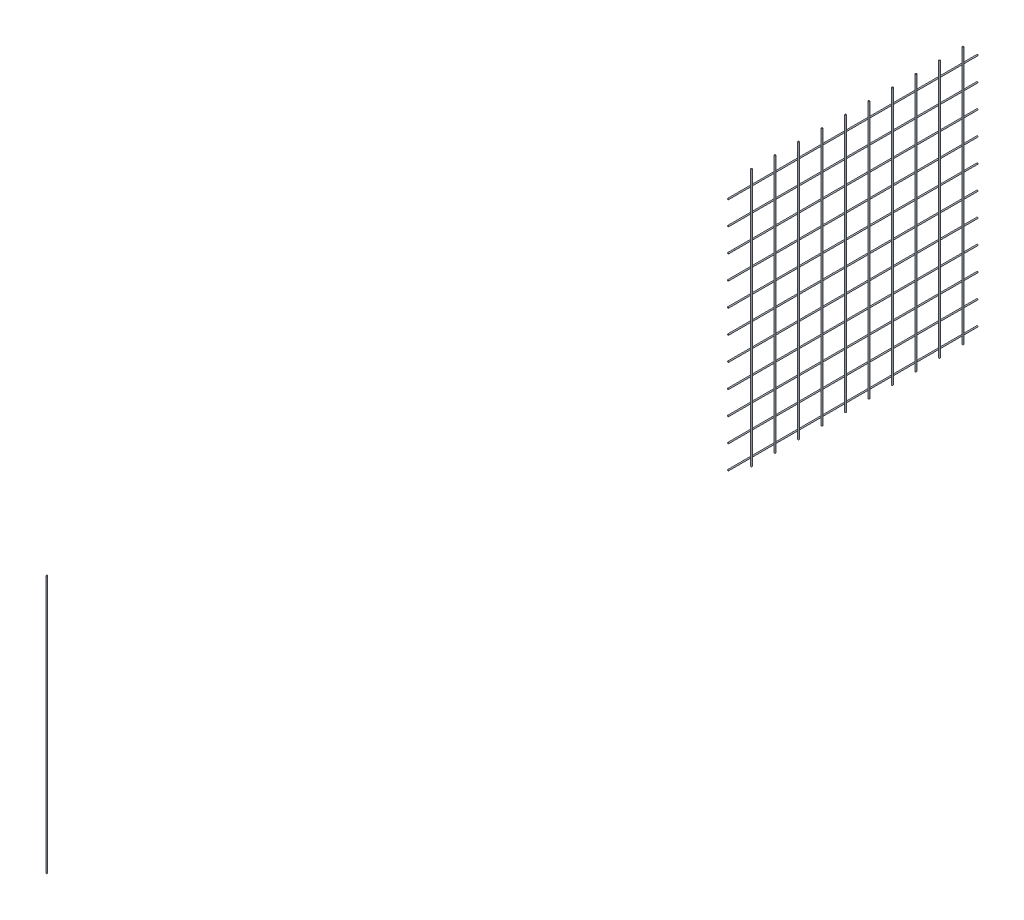
ISO-10303-21;
HEADER;
FILE_DESCRIPTION(('STEP AP214'),'2;1');
FILE_NAME('part.step','',(''),(''),'','','');
FILE_SCHEMA(('AUTOMOTIVE_DESIGN { 1 0 10303 214 1 1 1 1 }'));
ENDSEC;
DATA;
#1=APPLICATION_CONTEXT('core data for automotive mechanical design processes');
#2=APPLICATION_PROTOCOL_DEFINITION('international standard','automotive_design',2000,#1);
#3=PRODUCT_CONTEXT('',#1,'mechanical');
#4=PRODUCT('Part','Part','',(#3));
#5=PRODUCT_RELATED_PRODUCT_CATEGORY('part','',(#4));
#6=PRODUCT_DEFINITION_FORMATION('','',#4);
#7=PRODUCT_DEFINITION_CONTEXT('part definition',#1,'design');
#8=PRODUCT_DEFINITION('design','',#6,#7);
#9=PRODUCT_DEFINITION_SHAPE('','',#8);
#10=(LENGTH_UNIT() NAMED_UNIT(*) SI_UNIT(.MILLI.,.METRE.));
#11=(NAMED_UNIT(*) PLANE_ANGLE_UNIT() SI_UNIT($,.RADIAN.));
#12=(NAMED_UNIT(*) SI_UNIT($,.STERADIAN.) SOLID_ANGLE_UNIT());
#13=UNCERTAINTY_MEASURE_WITH_UNIT(LENGTH_MEASURE(1.E-05),#10,'distance_accuracy_value','');
#14=(GEOMETRIC_REPRESENTATION_CONTEXT(3) GLOBAL_UNCERTAINTY_ASSIGNED_CONTEXT((#13)) GLOBAL_UNIT_ASSIGNED_CONTEXT((#10,
#11,#12)) REPRESENTATION_CONTEXT('',''));
#15=CARTESIAN_POINT('',(0.,0.,0.));
#16=DIRECTION('',(0.,0.,1.));
#17=DIRECTION('',(1.,0.,0.));
#18=AXIS2_PLACEMENT_3D('',#15,#16,#17);
#19=CARTESIAN_POINT('',(-20.010000000005,1940.,-2403.));
#20=DIRECTION('',(0.,0.,1.));
#21=DIRECTION('',(1.,0.,0.));
#22=AXIS2_PLACEMENT_3D('',#19,#20,#21);
#23=PLANE('',#22);
#24=CARTESIAN_POINT('',(-5.32907051820075E-12,1300.,-2403.));
#25=DIRECTION('',(0.,0.,1.));
#26=DIRECTION('',(1.,0.,0.));
#27=AXIS2_PLACEMENT_3D('',#24,#25,#26);
#28=CIRCLE('',#27,1.49999999999986);
#29=CARTESIAN_POINT('',(1.49999999999454,1300.,-2403.));
#30=VERTEX_POINT('',#29);
#31=EDGE_CURVE('E58',#30,#30,#28,.T.);
#32=ORIENTED_EDGE('',*,*,#31,.T.);
#33=EDGE_LOOP('',(#32));
#34=FACE_BOUND('',#33,.T.);
#35=ADVANCED_FACE('F54',(#34),#23,.T.);
#36=CARTESIAN_POINT('',(0.,1300.,-3080.002));
#37=DIRECTION('',(0.,0.,1.));
#38=DIRECTION('',(1.,0.,0.));
#39=AXIS2_PLACEMENT_3D('',#36,#37,#38);
#40=CYLINDRICAL_SURFACE('',#39,1.49999999999986);
#41=CARTESIAN_POINT('',(-5.32907051820075E-12,1300.,-3040.));
#42=DIRECTION('',(0.,0.,-1.));
#43=DIRECTION('',(-1.,0.,0.));
#44=AXIS2_PLACEMENT_3D('',#41,#42,#43);
#45=CIRCLE('',#44,1.49999999999986);
#46=CARTESIAN_POINT('',(-1.50000000000519,1300.,-3040.));
#47=VERTEX_POINT('',#46);
#48=EDGE_CURVE('E11',#47,#47,#45,.T.);
#49=ORIENTED_EDGE('',*,*,#48,.F.);
#50=EDGE_LOOP('',(#49));
#51=FACE_BOUND('',#50,.T.);
#52=ORIENTED_EDGE('',*,*,#31,.F.);
#53=EDGE_LOOP('',(#52));
#54=FACE_BOUND('',#53,.T.);
#55=ADVANCED_FACE('F56',(#51,#54),#40,.T.);
#56=CARTESIAN_POINT('',(-15.4999999999997,-4.44089209850063E-13,-3040.));
#57=DIRECTION('',(0.,0.,-1.));
#58=DIRECTION('',(-1.,0.,0.));
#59=AXIS2_PLACEMENT_3D('',#56,#57,#58);
#60=PLANE('',#59);
#61=ORIENTED_EDGE('',*,*,#48,.T.);
#62=EDGE_LOOP('',(#61));
#63=FACE_BOUND('',#62,.T.);
#64=ADVANCED_FACE('F73',(#63),#60,.T.);
#65=CLOSED_SHELL('',(#35,#55,#64));
#66=MANIFOLD_SOLID_BREP('B2',#65);
#67=CARTESIAN_POINT('',(-20.010000000005,1940.,-2403.));
#68=DIRECTION('',(0.,0.,1.));
#69=DIRECTION('',(1.,0.,0.));
#70=AXIS2_PLACEMENT_3D('',#67,#68,#69);
#71=PLANE('',#70);
#72=CARTESIAN_POINT('',(0.,1360.,-2403.));
#73=DIRECTION('',(0.,0.,1.));
#74=DIRECTION('',(1.,0.,0.));
#75=AXIS2_PLACEMENT_3D('',#72,#73,#74);
#76=CIRCLE('',#75,1.49999999999986);
#77=CARTESIAN_POINT('',(1.49999999999988,1360.,-2403.));
#78=VERTEX_POINT('',#77);
#79=EDGE_CURVE('E105',#78,#78,#76,.T.);
#80=ORIENTED_EDGE('',*,*,#79,.T.);
#81=EDGE_LOOP('',(#80));
#82=FACE_BOUND('',#81,.T.);
#83=ADVANCED_FACE('F101',(#82),#71,.T.);
#84=CARTESIAN_POINT('',(0.,1360.,-3080.002));
#85=DIRECTION('',(0.,0.,1.));
#86=DIRECTION('',(1.,0.,0.));
#87=AXIS2_PLACEMENT_3D('',#84,#85,#86);
#88=CYLINDRICAL_SURFACE('',#87,1.49999999999986);
#89=CARTESIAN_POINT('',(0.,1360.,-3040.));
#90=DIRECTION('',(0.,0.,-1.));
#91=DIRECTION('',(-1.,0.,0.));
#92=AXIS2_PLACEMENT_3D('',#89,#90,#91);
#93=CIRCLE('',#92,1.49999999999986);
#94=CARTESIAN_POINT('',(-1.49999999999985,1360.,-3040.));
#95=VERTEX_POINT('',#94);
#96=EDGE_CURVE('E53',#95,#95,#93,.T.);
#97=ORIENTED_EDGE('',*,*,#96,.F.);
#98=EDGE_LOOP('',(#97));
#99=FACE_BOUND('',#98,.T.);
#100=ORIENTED_EDGE('',*,*,#79,.F.);
#101=EDGE_LOOP('',(#100));
#102=FACE_BOUND('',#101,.T.);
#103=ADVANCED_FACE('F103',(#99,#102),#88,.T.);
#104=CARTESIAN_POINT('',(-15.4999999999997,-4.44089209850063E-13,-3040.));
#105=DIRECTION('',(0.,0.,-1.));
#106=DIRECTION('',(-1.,0.,0.));
#107=AXIS2_PLACEMENT_3D('',#104,#105,#106);
#108=PLANE('',#107);
#109=ORIENTED_EDGE('',*,*,#96,.T.);
#110=EDGE_LOOP('',(#109));
#111=FACE_BOUND('',#110,.T.);
#112=ADVANCED_FACE('F120',(#111),#108,.T.);
#113=CLOSED_SHELL('',(#83,#103,#112));
#114=MANIFOLD_SOLID_BREP('B6',#113);
#115=CARTESIAN_POINT('',(-20.010000000005,1940.,-2403.));
#116=DIRECTION('',(0.,0.,1.));
#117=DIRECTION('',(1.,0.,0.));
#118=AXIS2_PLACEMENT_3D('',#115,#116,#117);
#119=PLANE('',#118);
#120=CARTESIAN_POINT('',(0.,1420.,-2403.));
#121=DIRECTION('',(0.,0.,1.));
#122=DIRECTION('',(1.,0.,0.));
#123=AXIS2_PLACEMENT_3D('',#120,#121,#122);
#124=CIRCLE('',#123,1.49999999999986);
#125=CARTESIAN_POINT('',(1.49999999999989,1420.,-2403.));
#126=VERTEX_POINT('',#125);
#127=EDGE_CURVE('E152',#126,#126,#124,.T.);
#128=ORIENTED_EDGE('',*,*,#127,.T.);
#129=EDGE_LOOP('',(#128));
#130=FACE_BOUND('',#129,.T.);
#131=ADVANCED_FACE('F148',(#130),#119,.T.);
#132=CARTESIAN_POINT('',(5.3550913703404E-12,1420.,-3080.002));
#133=DIRECTION('',(0.,0.,1.));
#134=DIRECTION('',(1.,0.,0.));
#135=AXIS2_PLACEMENT_3D('',#132,#133,#134);
#136=CYLINDRICAL_SURFACE('',#135,1.49999999999986);
#137=CARTESIAN_POINT('',(0.,1420.,-3040.));
#138=DIRECTION('',(0.,0.,-1.));
#139=DIRECTION('',(-1.,0.,0.));
#140=AXIS2_PLACEMENT_3D('',#137,#138,#139);
#141=CIRCLE('',#140,1.49999999999986);
#142=CARTESIAN_POINT('',(-1.49999999999984,1420.,-3040.));
#143=VERTEX_POINT('',#142);
#144=EDGE_CURVE('E100',#143,#143,#141,.T.);
#145=ORIENTED_EDGE('',*,*,#144,.F.);
#146=EDGE_LOOP('',(#145));
#147=FACE_BOUND('',#146,.T.);
#148=ORIENTED_EDGE('',*,*,#127,.F.);
#149=EDGE_LOOP('',(#148));
#150=FACE_BOUND('',#149,.T.);
#151=ADVANCED_FACE('F150',(#147,#150),#136,.T.);
#152=CARTESIAN_POINT('',(-15.4999999999997,-4.44089209850063E-13,-3040.));
#153=DIRECTION('',(0.,0.,-1.));
#154=DIRECTION('',(-1.,0.,0.));
#155=AXIS2_PLACEMENT_3D('',#152,#153,#154);
#156=PLANE('',#155);
#157=ORIENTED_EDGE('',*,*,#144,.T.);
#158=EDGE_LOOP('',(#157));
#159=FACE_BOUND('',#158,.T.);
#160=ADVANCED_FACE('F167',(#159),#156,.T.);
#161=CLOSED_SHELL('',(#131,#151,#160));
#162=MANIFOLD_SOLID_BREP('B48',#161);
#163=CARTESIAN_POINT('',(-20.010000000005,1940.,-2403.));
#164=DIRECTION('',(0.,0.,1.));
#165=DIRECTION('',(1.,0.,0.));
#166=AXIS2_PLACEMENT_3D('',#163,#164,#165);
#167=PLANE('',#166);
#168=CARTESIAN_POINT('',(0.,1480.,-2403.));
#169=DIRECTION('',(0.,0.,1.));
#170=DIRECTION('',(1.,0.,0.));
#171=AXIS2_PLACEMENT_3D('',#168,#169,#170);
#172=CIRCLE('',#171,1.49999999999986);
#173=CARTESIAN_POINT('',(1.49999999999989,1480.,-2403.));
#174=VERTEX_POINT('',#173);
#175=EDGE_CURVE('E199',#174,#174,#172,.T.);
#176=ORIENTED_EDGE('',*,*,#175,.T.);
#177=EDGE_LOOP('',(#176));
#178=FACE_BOUND('',#177,.T.);
#179=ADVANCED_FACE('F195',(#178),#167,.T.);
#180=CARTESIAN_POINT('',(0.,1480.,-3080.002));
#181=DIRECTION('',(0.,0.,1.));
#182=DIRECTION('',(1.,0.,0.));
#183=AXIS2_PLACEMENT_3D('',#180,#181,#182);
#184=CYLINDRICAL_SURFACE('',#183,1.49999999999986);
#185=CARTESIAN_POINT('',(0.,1480.,-3040.));
#186=DIRECTION('',(0.,0.,-1.));
#187=DIRECTION('',(-1.,0.,0.));
#188=AXIS2_PLACEMENT_3D('',#185,#186,#187);
#189=CIRCLE('',#188,1.49999999999986);
#190=CARTESIAN_POINT('',(-1.49999999999984,1480.,-3040.));
#191=VERTEX_POINT('',#190);
#192=EDGE_CURVE('E147',#191,#191,#189,.T.);
#193=ORIENTED_EDGE('',*,*,#192,.F.);
#194=EDGE_LOOP('',(#193));
#195=FACE_BOUND('',#194,.T.);
#196=ORIENTED_EDGE('',*,*,#175,.F.);
#197=EDGE_LOOP('',(#196));
#198=FACE_BOUND('',#197,.T.);
#199=ADVANCED_FACE('F197',(#195,#198),#184,.T.);
#200=CARTESIAN_POINT('',(-15.4999999999997,-4.44089209850063E-13,-3040.));
#201=DIRECTION('',(0.,0.,-1.));
#202=DIRECTION('',(-1.,0.,0.));
#203=AXIS2_PLACEMENT_3D('',#200,#201,#202);
#204=PLANE('',#203);
#205=ORIENTED_EDGE('',*,*,#192,.T.);
#206=EDGE_LOOP('',(#205));
#207=FACE_BOUND('',#206,.T.);
#208=ADVANCED_FACE('F214',(#207),#204,.T.);
#209=CLOSED_SHELL('',(#179,#199,#208));
#210=MANIFOLD_SOLID_BREP('B95',#209);
#211=CARTESIAN_POINT('',(-20.010000000005,1940.,-2403.));
#212=DIRECTION('',(0.,0.,1.));
#213=DIRECTION('',(1.,0.,0.));
#214=AXIS2_PLACEMENT_3D('',#211,#212,#213);
#215=PLANE('',#214);
#216=CARTESIAN_POINT('',(0.,1540.,-2403.));
#217=DIRECTION('',(0.,0.,1.));
#218=DIRECTION('',(1.,0.,0.));
#219=AXIS2_PLACEMENT_3D('',#216,#217,#218);
#220=CIRCLE('',#219,1.49999999999986);
#221=CARTESIAN_POINT('',(1.49999999999989,1540.,-2403.));
#222=VERTEX_POINT('',#221);
#223=EDGE_CURVE('E246',#222,#222,#220,.T.);
#224=ORIENTED_EDGE('',*,*,#223,.T.);
#225=EDGE_LOOP('',(#224));
#226=FACE_BOUND('',#225,.T.);
#227=ADVANCED_FACE('F242',(#226),#215,.T.);
#228=CARTESIAN_POINT('',(5.3550913703404E-12,1540.,-3080.002));
#229=DIRECTION('',(0.,0.,1.));
#230=DIRECTION('',(1.,0.,0.));
#231=AXIS2_PLACEMENT_3D('',#228,#229,#230);
#232=CYLINDRICAL_SURFACE('',#231,1.49999999999986);
#233=CARTESIAN_POINT('',(0.,1540.,-3040.));
#234=DIRECTION('',(0.,0.,-1.));
#235=DIRECTION('',(-1.,0.,0.));
#236=AXIS2_PLACEMENT_3D('',#233,#234,#235);
#237=CIRCLE('',#236,1.49999999999986);
#238=CARTESIAN_POINT('',(-1.49999999999984,1540.,-3040.));
#239=VERTEX_POINT('',#238);
#240=EDGE_CURVE('E194',#239,#239,#237,.T.);
#241=ORIENTED_EDGE('',*,*,#240,.F.);
#242=EDGE_LOOP('',(#241));
#243=FACE_BOUND('',#242,.T.);
#244=ORIENTED_EDGE('',*,*,#223,.F.);
#245=EDGE_LOOP('',(#244));
#246=FACE_BOUND('',#245,.T.);
#247=ADVANCED_FACE('F244',(#243,#246),#232,.T.);
#248=CARTESIAN_POINT('',(-15.4999999999997,-4.44089209850063E-13,-3040.));
#249=DIRECTION('',(0.,0.,-1.));
#250=DIRECTION('',(-1.,0.,0.));
#251=AXIS2_PLACEMENT_3D('',#248,#249,#250);
#252=PLANE('',#251);
#253=ORIENTED_EDGE('',*,*,#240,.T.);
#254=EDGE_LOOP('',(#253));
#255=FACE_BOUND('',#254,.T.);
#256=ADVANCED_FACE('F261',(#255),#252,.T.);
#257=CLOSED_SHELL('',(#227,#247,#256));
#258=MANIFOLD_SOLID_BREP('B142',#257);
#259=CARTESIAN_POINT('',(-20.010000000005,1940.,-2403.));
#260=DIRECTION('',(0.,0.,1.));
#261=DIRECTION('',(1.,0.,0.));
#262=AXIS2_PLACEMENT_3D('',#259,#260,#261);
#263=PLANE('',#262);
#264=CARTESIAN_POINT('',(0.,1600.,-2403.));
#265=DIRECTION('',(0.,0.,1.));
#266=DIRECTION('',(1.,0.,0.));
#267=AXIS2_PLACEMENT_3D('',#264,#265,#266);
#268=CIRCLE('',#267,1.49999999999986);
#269=CARTESIAN_POINT('',(1.49999999999989,1600.,-2403.));
#270=VERTEX_POINT('',#269);
#271=EDGE_CURVE('E293',#270,#270,#268,.T.);
#272=ORIENTED_EDGE('',*,*,#271,.T.);
#273=EDGE_LOOP('',(#272));
#274=FACE_BOUND('',#273,.T.);
#275=ADVANCED_FACE('F289',(#274),#263,.T.);
#276=CARTESIAN_POINT('',(0.,1600.,-3080.002));
#277=DIRECTION('',(0.,0.,1.));
#278=DIRECTION('',(1.,0.,0.));
#279=AXIS2_PLACEMENT_3D('',#276,#277,#278);
#280=CYLINDRICAL_SURFACE('',#279,1.49999999999986);
#281=CARTESIAN_POINT('',(0.,1600.,-3040.));
#282=DIRECTION('',(0.,0.,-1.));
#283=DIRECTION('',(-1.,0.,0.));
#284=AXIS2_PLACEMENT_3D('',#281,#282,#283);
#285=CIRCLE('',#284,1.49999999999986);
#286=CARTESIAN_POINT('',(-1.49999999999984,1600.,-3040.));
#287=VERTEX_POINT('',#286);
#288=EDGE_CURVE('E241',#287,#287,#285,.T.);
#289=ORIENTED_EDGE('',*,*,#288,.F.);
#290=EDGE_LOOP('',(#289));
#291=FACE_BOUND('',#290,.T.);
#292=ORIENTED_EDGE('',*,*,#271,.F.);
#293=EDGE_LOOP('',(#292));
#294=FACE_BOUND('',#293,.T.);
#295=ADVANCED_FACE('F291',(#291,#294),#280,.T.);
#296=CARTESIAN_POINT('',(-15.4999999999997,-4.44089209850063E-13,-3040.));
#297=DIRECTION('',(0.,0.,-1.));
#298=DIRECTION('',(-1.,0.,0.));
#299=AXIS2_PLACEMENT_3D('',#296,#297,#298);
#300=PLANE('',#299);
#301=ORIENTED_EDGE('',*,*,#288,.T.);
#302=EDGE_LOOP('',(#301));
#303=FACE_BOUND('',#302,.T.);
#304=ADVANCED_FACE('F308',(#303),#300,.T.);
#305=CLOSED_SHELL('',(#275,#295,#304));
#306=MANIFOLD_SOLID_BREP('B189',#305);
#307=CARTESIAN_POINT('',(-20.010000000005,1940.,-2403.));
#308=DIRECTION('',(0.,0.,1.));
#309=DIRECTION('',(1.,0.,0.));
#310=AXIS2_PLACEMENT_3D('',#307,#308,#309);
#311=PLANE('',#310);
#312=CARTESIAN_POINT('',(0.,1660.,-2403.));
#313=DIRECTION('',(0.,0.,1.));
#314=DIRECTION('',(1.,0.,0.));
#315=AXIS2_PLACEMENT_3D('',#312,#313,#314);
#316=CIRCLE('',#315,1.49999999999986);
#317=CARTESIAN_POINT('',(1.49999999999986,1660.,-2403.));
#318=VERTEX_POINT('',#317);
#319=EDGE_CURVE('E340',#318,#318,#316,.T.);
#320=ORIENTED_EDGE('',*,*,#319,.T.);
#321=EDGE_LOOP('',(#320));
#322=FACE_BOUND('',#321,.T.);
#323=ADVANCED_FACE('F336',(#322),#311,.T.);
#324=CARTESIAN_POINT('',(5.32907051820075E-12,1660.,-3080.002));
#325=DIRECTION('',(0.,0.,1.));
#326=DIRECTION('',(1.,0.,0.));
#327=AXIS2_PLACEMENT_3D('',#324,#325,#326);
#328=CYLINDRICAL_SURFACE('',#327,1.49999999999986);
#329=CARTESIAN_POINT('',(0.,1660.,-3040.));
#330=DIRECTION('',(0.,0.,-1.));
#331=DIRECTION('',(-1.,0.,0.));
#332=AXIS2_PLACEMENT_3D('',#329,#330,#331);
#333=CIRCLE('',#332,1.49999999999986);
#334=CARTESIAN_POINT('',(-1.49999999999986,1660.,-3040.));
#335=VERTEX_POINT('',#334);
#336=EDGE_CURVE('E288',#335,#335,#333,.T.);
#337=ORIENTED_EDGE('',*,*,#336,.F.);
#338=EDGE_LOOP('',(#337));
#339=FACE_BOUND('',#338,.T.);
#340=ORIENTED_EDGE('',*,*,#319,.F.);
#341=EDGE_LOOP('',(#340));
#342=FACE_BOUND('',#341,.T.);
#343=ADVANCED_FACE('F338',(#339,#342),#328,.T.);
#344=CARTESIAN_POINT('',(-15.4999999999997,-4.44089209850063E-13,-3040.));
#345=DIRECTION('',(0.,0.,-1.));
#346=DIRECTION('',(-1.,0.,0.));
#347=AXIS2_PLACEMENT_3D('',#344,#345,#346);
#348=PLANE('',#347);
#349=ORIENTED_EDGE('',*,*,#336,.T.);
#350=EDGE_LOOP('',(#349));
#351=FACE_BOUND('',#350,.T.);
#352=ADVANCED_FACE('F355',(#351),#348,.T.);
#353=CLOSED_SHELL('',(#323,#343,#352));
#354=MANIFOLD_SOLID_BREP('B236',#353);
#355=CARTESIAN_POINT('',(-20.010000000005,1940.,-2403.));
#356=DIRECTION('',(0.,0.,1.));
#357=DIRECTION('',(1.,0.,0.));
#358=AXIS2_PLACEMENT_3D('',#355,#356,#357);
#359=PLANE('',#358);
#360=CARTESIAN_POINT('',(0.,1720.,-2403.));
#361=DIRECTION('',(0.,0.,1.));
#362=DIRECTION('',(1.,0.,0.));
#363=AXIS2_PLACEMENT_3D('',#360,#361,#362);
#364=CIRCLE('',#363,1.49999999999986);
#365=CARTESIAN_POINT('',(1.49999999999986,1720.,-2403.));
#366=VERTEX_POINT('',#365);
#367=EDGE_CURVE('E387',#366,#366,#364,.T.);
#368=ORIENTED_EDGE('',*,*,#367,.T.);
#369=EDGE_LOOP('',(#368));
#370=FACE_BOUND('',#369,.T.);
#371=ADVANCED_FACE('F383',(#370),#359,.T.);
#372=CARTESIAN_POINT('',(0.,1720.,-3080.002));
#373=DIRECTION('',(0.,0.,1.));
#374=DIRECTION('',(1.,0.,0.));
#375=AXIS2_PLACEMENT_3D('',#372,#373,#374);
#376=CYLINDRICAL_SURFACE('',#375,1.49999999999986);
#377=CARTESIAN_POINT('',(0.,1720.,-3040.));
#378=DIRECTION('',(0.,0.,-1.));
#379=DIRECTION('',(-1.,0.,0.));
#380=AXIS2_PLACEMENT_3D('',#377,#378,#379);
#381=CIRCLE('',#380,1.49999999999986);
#382=CARTESIAN_POINT('',(-1.49999999999986,1720.,-3040.));
#383=VERTEX_POINT('',#382);
#384=EDGE_CURVE('E335',#383,#383,#381,.T.);
#385=ORIENTED_EDGE('',*,*,#384,.F.);
#386=EDGE_LOOP('',(#385));
#387=FACE_BOUND('',#386,.T.);
#388=ORIENTED_EDGE('',*,*,#367,.F.);
#389=EDGE_LOOP('',(#388));
#390=FACE_BOUND('',#389,.T.);
#391=ADVANCED_FACE('F385',(#387,#390),#376,.T.);
#392=CARTESIAN_POINT('',(-15.4999999999997,-4.44089209850063E-13,-3040.));
#393=DIRECTION('',(0.,0.,-1.));
#394=DIRECTION('',(-1.,0.,0.));
#395=AXIS2_PLACEMENT_3D('',#392,#393,#394);
#396=PLANE('',#395);
#397=ORIENTED_EDGE('',*,*,#384,.T.);
#398=EDGE_LOOP('',(#397));
#399=FACE_BOUND('',#398,.T.);
#400=ADVANCED_FACE('F402',(#399),#396,.T.);
#401=CLOSED_SHELL('',(#371,#391,#400));
#402=MANIFOLD_SOLID_BREP('B283',#401);
#403=CARTESIAN_POINT('',(-20.010000000005,1940.,-2403.));
#404=DIRECTION('',(0.,0.,1.));
#405=DIRECTION('',(1.,0.,0.));
#406=AXIS2_PLACEMENT_3D('',#403,#404,#405);
#407=PLANE('',#406);
#408=CARTESIAN_POINT('',(0.,1780.,-2403.));
#409=DIRECTION('',(0.,0.,1.));
#410=DIRECTION('',(1.,0.,0.));
#411=AXIS2_PLACEMENT_3D('',#408,#409,#410);
#412=CIRCLE('',#411,1.49999999999986);
#413=CARTESIAN_POINT('',(1.49999999999986,1780.,-2403.));
#414=VERTEX_POINT('',#413);
#415=EDGE_CURVE('E434',#414,#414,#412,.T.);
#416=ORIENTED_EDGE('',*,*,#415,.T.);
#417=EDGE_LOOP('',(#416));
#418=FACE_BOUND('',#417,.T.);
#419=ADVANCED_FACE('F430',(#418),#407,.T.);
#420=CARTESIAN_POINT('',(0.,1780.,-3080.002));
#421=DIRECTION('',(0.,0.,1.));
#422=DIRECTION('',(1.,0.,0.));
#423=AXIS2_PLACEMENT_3D('',#420,#421,#422);
#424=CYLINDRICAL_SURFACE('',#423,1.49999999999986);
#425=CARTESIAN_POINT('',(0.,1780.,-3040.));
#426=DIRECTION('',(0.,0.,-1.));
#427=DIRECTION('',(-1.,0.,0.));
#428=AXIS2_PLACEMENT_3D('',#425,#426,#427);
#429=CIRCLE('',#428,1.49999999999986);
#430=CARTESIAN_POINT('',(-1.49999999999986,1780.,-3040.));
#431=VERTEX_POINT('',#430);
#432=EDGE_CURVE('E382',#431,#431,#429,.T.);
#433=ORIENTED_EDGE('',*,*,#432,.F.);
#434=EDGE_LOOP('',(#433));
#435=FACE_BOUND('',#434,.T.);
#436=ORIENTED_EDGE('',*,*,#415,.F.);
#437=EDGE_LOOP('',(#436));
#438=FACE_BOUND('',#437,.T.);
#439=ADVANCED_FACE('F432',(#435,#438),#424,.T.);
#440=CARTESIAN_POINT('',(-15.4999999999997,-4.44089209436472E-13,-3040.));
#441=DIRECTION('',(0.,0.,-1.));
#442=DIRECTION('',(-1.,0.,0.));
#443=AXIS2_PLACEMENT_3D('',#440,#441,#442);
#444=PLANE('',#443);
#445=ORIENTED_EDGE('',*,*,#432,.T.);
#446=EDGE_LOOP('',(#445));
#447=FACE_BOUND('',#446,.T.);
#448=ADVANCED_FACE('F449',(#447),#444,.T.);
#449=CLOSED_SHELL('',(#419,#439,#448));
#450=MANIFOLD_SOLID_BREP('B330',#449);
#451=CARTESIAN_POINT('',(-20.010000000005,1940.,-2403.));
#452=DIRECTION('',(0.,0.,1.));
#453=DIRECTION('',(1.,0.,0.));
#454=AXIS2_PLACEMENT_3D('',#451,#452,#453);
#455=PLANE('',#454);
#456=CARTESIAN_POINT('',(0.,1840.,-2403.));
#457=DIRECTION('',(0.,0.,1.));
#458=DIRECTION('',(1.,0.,0.));
#459=AXIS2_PLACEMENT_3D('',#456,#457,#458);
#460=CIRCLE('',#459,1.49999999999986);
#461=CARTESIAN_POINT('',(1.49999999999986,1840.,-2403.));
#462=VERTEX_POINT('',#461);
#463=EDGE_CURVE('E481',#462,#462,#460,.T.);
#464=ORIENTED_EDGE('',*,*,#463,.T.);
#465=EDGE_LOOP('',(#464));
#466=FACE_BOUND('',#465,.T.);
#467=ADVANCED_FACE('F477',(#466),#455,.T.);
#468=CARTESIAN_POINT('',(0.,1840.,-3080.002));
#469=DIRECTION('',(0.,0.,1.));
#470=DIRECTION('',(1.,0.,0.));
#471=AXIS2_PLACEMENT_3D('',#468,#469,#470);
#472=CYLINDRICAL_SURFACE('',#471,1.49999999999986);
#473=CARTESIAN_POINT('',(0.,1840.,-3040.));
#474=DIRECTION('',(0.,0.,-1.));
#475=DIRECTION('',(-1.,0.,0.));
#476=AXIS2_PLACEMENT_3D('',#473,#474,#475);
#477=CIRCLE('',#476,1.49999999999986);
#478=CARTESIAN_POINT('',(-1.49999999999986,1840.,-3040.));
#479=VERTEX_POINT('',#478);
#480=EDGE_CURVE('E429',#479,#479,#477,.T.);
#481=ORIENTED_EDGE('',*,*,#480,.F.);
#482=EDGE_LOOP('',(#481));
#483=FACE_BOUND('',#482,.T.);
#484=ORIENTED_EDGE('',*,*,#463,.F.);
#485=EDGE_LOOP('',(#484));
#486=FACE_BOUND('',#485,.T.);
#487=ADVANCED_FACE('F479',(#483,#486),#472,.T.);
#488=CARTESIAN_POINT('',(-15.4999999999997,-4.44089209436472E-13,-3040.));
#489=DIRECTION('',(0.,0.,-1.));
#490=DIRECTION('',(-1.,0.,0.));
#491=AXIS2_PLACEMENT_3D('',#488,#489,#490);
#492=PLANE('',#491);
#493=ORIENTED_EDGE('',*,*,#480,.T.);
#494=EDGE_LOOP('',(#493));
#495=FACE_BOUND('',#494,.T.);
#496=ADVANCED_FACE('F496',(#495),#492,.T.);
#497=CLOSED_SHELL('',(#467,#487,#496));
#498=MANIFOLD_SOLID_BREP('B377',#497);
#499=CARTESIAN_POINT('',(-20.010000000005,1940.,-2403.));
#500=DIRECTION('',(0.,0.,1.));
#501=DIRECTION('',(1.,0.,0.));
#502=AXIS2_PLACEMENT_3D('',#499,#500,#501);
#503=PLANE('',#502);
#504=CARTESIAN_POINT('',(0.,1900.,-2403.));
#505=DIRECTION('',(0.,0.,1.));
#506=DIRECTION('',(1.,0.,0.));
#507=AXIS2_PLACEMENT_3D('',#504,#505,#506);
#508=CIRCLE('',#507,1.49999999999986);
#509=CARTESIAN_POINT('',(1.49999999999986,1900.,-2403.));
#510=VERTEX_POINT('',#509);
#511=EDGE_CURVE('E528',#510,#510,#508,.T.);
#512=ORIENTED_EDGE('',*,*,#511,.T.);
#513=EDGE_LOOP('',(#512));
#514=FACE_BOUND('',#513,.T.);
#515=ADVANCED_FACE('F524',(#514),#503,.T.);
#516=CARTESIAN_POINT('',(0.,1900.,-3080.002));
#517=DIRECTION('',(0.,0.,1.));
#518=DIRECTION('',(1.,0.,0.));
#519=AXIS2_PLACEMENT_3D('',#516,#517,#518);
#520=CYLINDRICAL_SURFACE('',#519,1.49999999999986);
#521=CARTESIAN_POINT('',(0.,1900.,-3040.));
#522=DIRECTION('',(0.,0.,-1.));
#523=DIRECTION('',(-1.,0.,0.));
#524=AXIS2_PLACEMENT_3D('',#521,#522,#523);
#525=CIRCLE('',#524,1.49999999999986);
#526=CARTESIAN_POINT('',(-1.49999999999986,1900.,-3040.));
#527=VERTEX_POINT('',#526);
#528=EDGE_CURVE('E476',#527,#527,#525,.T.);
#529=ORIENTED_EDGE('',*,*,#528,.F.);
#530=EDGE_LOOP('',(#529));
#531=FACE_BOUND('',#530,.T.);
#532=ORIENTED_EDGE('',*,*,#511,.F.);
#533=EDGE_LOOP('',(#532));
#534=FACE_BOUND('',#533,.T.);
#535=ADVANCED_FACE('F526',(#531,#534),#520,.T.);
#536=CARTESIAN_POINT('',(-15.4999999999997,-4.44089209436472E-13,-3040.));
#537=DIRECTION('',(0.,0.,-1.));
#538=DIRECTION('',(-1.,0.,0.));
#539=AXIS2_PLACEMENT_3D('',#536,#537,#538);
#540=PLANE('',#539);
#541=ORIENTED_EDGE('',*,*,#528,.T.);
#542=EDGE_LOOP('',(#541));
#543=FACE_BOUND('',#542,.T.);
#544=ADVANCED_FACE('F543',(#543),#540,.T.);
#545=CLOSED_SHELL('',(#515,#535,#544));
#546=MANIFOLD_SOLID_BREP('B424',#545);
#547=CARTESIAN_POINT('',(-20.0099999999999,1281.49999999999,-20.0000000000129));
#548=DIRECTION('',(0.,-1.,0.));
#549=DIRECTION('',(0.,0.,-1.));
#550=AXIS2_PLACEMENT_3D('',#547,#548,#549);
#551=PLANE('',#550);
#552=CARTESIAN_POINT('',(2.9999999999997,1281.49999999999,-660.000000000007));
#553=DIRECTION('',(0.,-1.,0.));
#554=DIRECTION('',(0.,0.,-1.));
#555=AXIS2_PLACEMENT_3D('',#552,#553,#554);
#556=CIRCLE('',#555,1.5);
#557=CARTESIAN_POINT('',(2.9999999999997,1281.49999999999,-661.500000000007));
#558=VERTEX_POINT('',#557);
#559=EDGE_CURVE('E575',#558,#558,#556,.T.);
#560=ORIENTED_EDGE('',*,*,#559,.T.);
#561=EDGE_LOOP('',(#560));
#562=FACE_BOUND('',#561,.T.);
#563=ADVANCED_FACE('F571',(#562),#551,.T.);
#564=CARTESIAN_POINT('',(2.9999999999948,1980.00199999999,-660.000000000003));
#565=DIRECTION('',(0.,-1.,0.));
#566=DIRECTION('',(0.,0.,-1.));
#567=AXIS2_PLACEMENT_3D('',#564,#565,#566);
#568=CYLINDRICAL_SURFACE('',#567,1.5);
#569=CARTESIAN_POINT('',(2.99999999999478,1939.99999999999,-660.000000000007));
#570=DIRECTION('',(0.,1.,0.));
#571=DIRECTION('',(0.,0.,1.));
#572=AXIS2_PLACEMENT_3D('',#569,#570,#571);
#573=CIRCLE('',#572,1.5);
#574=CARTESIAN_POINT('',(2.99999999999478,1939.99999999999,-658.500000000007));
#575=VERTEX_POINT('',#574);
#576=EDGE_CURVE('E523',#575,#575,#573,.T.);
#577=ORIENTED_EDGE('',*,*,#576,.F.);
#578=EDGE_LOOP('',(#577));
#579=FACE_BOUND('',#578,.T.);
#580=ORIENTED_EDGE('',*,*,#559,.F.);
#581=EDGE_LOOP('',(#580));
#582=FACE_BOUND('',#581,.T.);
#583=ADVANCED_FACE('F573',(#579,#582),#568,.T.);
#584=CARTESIAN_POINT('',(-15.5000000000052,1940.00000000001,-3060.));
#585=DIRECTION('',(0.,1.,0.));
#586=DIRECTION('',(0.,0.,1.));
#587=AXIS2_PLACEMENT_3D('',#584,#585,#586);
#588=PLANE('',#587);
#589=ORIENTED_EDGE('',*,*,#576,.T.);
#590=EDGE_LOOP('',(#589));
#591=FACE_BOUND('',#590,.T.);
#592=ADVANCED_FACE('F590',(#591),#588,.T.);
#593=CLOSED_SHELL('',(#563,#583,#592));
#594=MANIFOLD_SOLID_BREP('B471',#593);
#595=CARTESIAN_POINT('',(-20.0099999999999,1281.49999999999,-2403.));
#596=DIRECTION('',(0.,-1.,0.));
#597=DIRECTION('',(0.,0.,-1.));
#598=AXIS2_PLACEMENT_3D('',#595,#596,#597);
#599=PLANE('',#598);
#600=CARTESIAN_POINT('',(3.00000000000547,1281.5,-3000.));
#601=DIRECTION('',(0.,-1.,0.));
#602=DIRECTION('',(0.,0.,-1.));
#603=AXIS2_PLACEMENT_3D('',#600,#601,#602);
#604=CIRCLE('',#603,1.5);
#605=CARTESIAN_POINT('',(3.00000000000547,1281.5,-3001.5));
#606=VERTEX_POINT('',#605);
#607=EDGE_CURVE('E622',#606,#606,#604,.T.);
#608=ORIENTED_EDGE('',*,*,#607,.T.);
#609=EDGE_LOOP('',(#608));
#610=FACE_BOUND('',#609,.T.);
#611=ADVANCED_FACE('F618',(#610),#599,.T.);
#612=CARTESIAN_POINT('',(3.00000000000013,1980.002,-3000.));
#613=DIRECTION('',(0.,-1.,0.));
#614=DIRECTION('',(0.,0.,-1.));
#615=AXIS2_PLACEMENT_3D('',#612,#613,#614);
#616=CYLINDRICAL_SURFACE('',#615,1.5);
#617=CARTESIAN_POINT('',(3.00000000000011,1940.,-3000.));
#618=DIRECTION('',(0.,1.,0.));
#619=DIRECTION('',(0.,0.,1.));
#620=AXIS2_PLACEMENT_3D('',#617,#618,#619);
#621=CIRCLE('',#620,1.5);
#622=CARTESIAN_POINT('',(3.00000000000011,1940.,-2998.5));
#623=VERTEX_POINT('',#622);
#624=EDGE_CURVE('E570',#623,#623,#621,.T.);
#625=ORIENTED_EDGE('',*,*,#624,.F.);
#626=EDGE_LOOP('',(#625));
#627=FACE_BOUND('',#626,.T.);
#628=ORIENTED_EDGE('',*,*,#607,.F.);
#629=EDGE_LOOP('',(#628));
#630=FACE_BOUND('',#629,.T.);
#631=ADVANCED_FACE('F620',(#627,#630),#616,.T.);
#632=CARTESIAN_POINT('',(-15.5000000000052,1940.00000000001,-3060.));
#633=DIRECTION('',(0.,1.,0.));
#634=DIRECTION('',(0.,0.,1.));
#635=AXIS2_PLACEMENT_3D('',#632,#633,#634);
#636=PLANE('',#635);
#637=ORIENTED_EDGE('',*,*,#624,.T.);
#638=EDGE_LOOP('',(#637));
#639=FACE_BOUND('',#638,.T.);
#640=ADVANCED_FACE('F638',(#639),#636,.T.);
#641=CLOSED_SHELL('',(#611,#631,#640));
#642=MANIFOLD_SOLID_BREP('B518',#641);
#643=CARTESIAN_POINT('',(-20.0099999999999,1281.49999999999,-2403.));
#644=DIRECTION('',(0.,-1.,0.));
#645=DIRECTION('',(0.,0.,-1.));
#646=AXIS2_PLACEMENT_3D('',#643,#644,#645);
#647=PLANE('',#646);
#648=CARTESIAN_POINT('',(3.00000000000547,1281.5,-2940.));
#649=DIRECTION('',(0.,-1.,0.));
#650=DIRECTION('',(0.,0.,-1.));
#651=AXIS2_PLACEMENT_3D('',#648,#649,#650);
#652=CIRCLE('',#651,1.5);
#653=CARTESIAN_POINT('',(3.00000000000547,1281.5,-2941.5));
#654=VERTEX_POINT('',#653);
#655=EDGE_CURVE('E670',#654,#654,#652,.T.);
#656=ORIENTED_EDGE('',*,*,#655,.T.);
#657=EDGE_LOOP('',(#656));
#658=FACE_BOUND('',#657,.T.);
#659=ADVANCED_FACE('F666',(#658),#647,.T.);
#660=CARTESIAN_POINT('',(3.00000000000013,1980.002,-2940.));
#661=DIRECTION('',(0.,-1.,0.));
#662=DIRECTION('',(0.,0.,-1.));
#663=AXIS2_PLACEMENT_3D('',#660,#661,#662);
#664=CYLINDRICAL_SURFACE('',#663,1.5);
#665=CARTESIAN_POINT('',(3.00000000000011,1940.,-2940.));
#666=DIRECTION('',(0.,1.,0.));
#667=DIRECTION('',(0.,0.,1.));
#668=AXIS2_PLACEMENT_3D('',#665,#666,#667);
#669=CIRCLE('',#668,1.5);
#670=CARTESIAN_POINT('',(3.00000000000011,1940.,-2938.5));
#671=VERTEX_POINT('',#670);
#672=EDGE_CURVE('E617',#671,#671,#669,.T.);
#673=ORIENTED_EDGE('',*,*,#672,.F.);
#674=EDGE_LOOP('',(#673));
#675=FACE_BOUND('',#674,.T.);
#676=ORIENTED_EDGE('',*,*,#655,.F.);
#677=EDGE_LOOP('',(#676));
#678=FACE_BOUND('',#677,.T.);
#679=ADVANCED_FACE('F668',(#675,#678),#664,.T.);
#680=CARTESIAN_POINT('',(-15.5000000000052,1940.00000000001,-3060.));
#681=DIRECTION('',(0.,1.,0.));
#682=DIRECTION('',(0.,0.,1.));
#683=AXIS2_PLACEMENT_3D('',#680,#681,#682);
#684=PLANE('',#683);
#685=ORIENTED_EDGE('',*,*,#672,.T.);
#686=EDGE_LOOP('',(#685));
#687=FACE_BOUND('',#686,.T.);
#688=ADVANCED_FACE('F685',(#687),#684,.T.);
#689=CLOSED_SHELL('',(#659,#679,#688));
#690=MANIFOLD_SOLID_BREP('B565',#689);
#691=CARTESIAN_POINT('',(-20.0099999999999,1281.49999999999,-2403.));
#692=DIRECTION('',(0.,-1.,0.));
#693=DIRECTION('',(0.,0.,-1.));
#694=AXIS2_PLACEMENT_3D('',#691,#692,#693);
#695=PLANE('',#694);
#696=CARTESIAN_POINT('',(3.00000000000502,1281.5,-2880.));
#697=DIRECTION('',(0.,-1.,0.));
#698=DIRECTION('',(0.,0.,-1.));
#699=AXIS2_PLACEMENT_3D('',#696,#697,#698);
#700=CIRCLE('',#699,1.5);
#701=CARTESIAN_POINT('',(3.00000000000503,1281.5,-2881.5));
#702=VERTEX_POINT('',#701);
#703=EDGE_CURVE('E717',#702,#702,#700,.T.);
#704=ORIENTED_EDGE('',*,*,#703,.T.);
#705=EDGE_LOOP('',(#704));
#706=FACE_BOUND('',#705,.T.);
#707=ADVANCED_FACE('F713',(#706),#695,.T.);
#708=CARTESIAN_POINT('',(3.00000000000013,1980.002,-2880.));
#709=DIRECTION('',(0.,-1.,0.));
#710=DIRECTION('',(0.,0.,-1.));
#711=AXIS2_PLACEMENT_3D('',#708,#709,#710);
#712=CYLINDRICAL_SURFACE('',#711,1.5);
#713=CARTESIAN_POINT('',(3.00000000000011,1940.,-2880.));
#714=DIRECTION('',(0.,1.,0.));
#715=DIRECTION('',(0.,0.,1.));
#716=AXIS2_PLACEMENT_3D('',#713,#714,#715);
#717=CIRCLE('',#716,1.5);
#718=CARTESIAN_POINT('',(3.00000000000011,1940.,-2878.5));
#719=VERTEX_POINT('',#718);
#720=EDGE_CURVE('E665',#719,#719,#717,.T.);
#721=ORIENTED_EDGE('',*,*,#720,.F.);
#722=EDGE_LOOP('',(#721));
#723=FACE_BOUND('',#722,.T.);
#724=ORIENTED_EDGE('',*,*,#703,.F.);
#725=EDGE_LOOP('',(#724));
#726=FACE_BOUND('',#725,.T.);
#727=ADVANCED_FACE('F715',(#723,#726),#712,.T.);
#728=CARTESIAN_POINT('',(-15.5000000000052,1940.00000000001,-3060.));
#729=DIRECTION('',(0.,1.,0.));
#730=DIRECTION('',(0.,0.,1.));
#731=AXIS2_PLACEMENT_3D('',#728,#729,#730);
#732=PLANE('',#731);
#733=ORIENTED_EDGE('',*,*,#720,.T.);
#734=EDGE_LOOP('',(#733));
#735=FACE_BOUND('',#734,.T.);
#736=ADVANCED_FACE('F732',(#735),#732,.T.);
#737=CLOSED_SHELL('',(#707,#727,#736));
#738=MANIFOLD_SOLID_BREP('B612',#737);
#739=CARTESIAN_POINT('',(-20.0099999999999,1281.49999999999,-2403.));
#740=DIRECTION('',(0.,-1.,0.));
#741=DIRECTION('',(0.,0.,-1.));
#742=AXIS2_PLACEMENT_3D('',#739,#740,#741);
#743=PLANE('',#742);
#744=CARTESIAN_POINT('',(3.00000000000502,1281.5,-2820.));
#745=DIRECTION('',(0.,-1.,0.));
#746=DIRECTION('',(0.,0.,-1.));
#747=AXIS2_PLACEMENT_3D('',#744,#745,#746);
#748=CIRCLE('',#747,1.5);
#749=CARTESIAN_POINT('',(3.00000000000503,1281.5,-2821.5));
#750=VERTEX_POINT('',#749);
#751=EDGE_CURVE('E764',#750,#750,#748,.T.);
#752=ORIENTED_EDGE('',*,*,#751,.T.);
#753=EDGE_LOOP('',(#752));
#754=FACE_BOUND('',#753,.T.);
#755=ADVANCED_FACE('F760',(#754),#743,.T.);
#756=CARTESIAN_POINT('',(3.00000000000013,1980.002,-2820.));
#757=DIRECTION('',(0.,-1.,0.));
#758=DIRECTION('',(0.,0.,-1.));
#759=AXIS2_PLACEMENT_3D('',#756,#757,#758);
#760=CYLINDRICAL_SURFACE('',#759,1.5);
#761=CARTESIAN_POINT('',(3.00000000000011,1940.,-2820.));
#762=DIRECTION('',(0.,1.,0.));
#763=DIRECTION('',(0.,0.,1.));
#764=AXIS2_PLACEMENT_3D('',#761,#762,#763);
#765=CIRCLE('',#764,1.5);
#766=CARTESIAN_POINT('',(3.00000000000011,1940.,-2818.5));
#767=VERTEX_POINT('',#766);
#768=EDGE_CURVE('E712',#767,#767,#765,.T.);
#769=ORIENTED_EDGE('',*,*,#768,.F.);
#770=EDGE_LOOP('',(#769));
#771=FACE_BOUND('',#770,.T.);
#772=ORIENTED_EDGE('',*,*,#751,.F.);
#773=EDGE_LOOP('',(#772));
#774=FACE_BOUND('',#773,.T.);
#775=ADVANCED_FACE('F762',(#771,#774),#760,.T.);
#776=CARTESIAN_POINT('',(-15.5000000000052,1940.00000000001,-3060.));
#777=DIRECTION('',(0.,1.,0.));
#778=DIRECTION('',(0.,0.,1.));
#779=AXIS2_PLACEMENT_3D('',#776,#777,#778);
#780=PLANE('',#779);
#781=ORIENTED_EDGE('',*,*,#768,.T.);
#782=EDGE_LOOP('',(#781));
#783=FACE_BOUND('',#782,.T.);
#784=ADVANCED_FACE('F780',(#783),#780,.T.);
#785=CLOSED_SHELL('',(#755,#775,#784));
#786=MANIFOLD_SOLID_BREP('B660',#785);
#787=CARTESIAN_POINT('',(-20.0099999999999,1281.49999999999,-2403.));
#788=DIRECTION('',(0.,-1.,0.));
#789=DIRECTION('',(0.,0.,-1.));
#790=AXIS2_PLACEMENT_3D('',#787,#788,#789);
#791=PLANE('',#790);
#792=CARTESIAN_POINT('',(3.00000000000502,1281.5,-2760.));
#793=DIRECTION('',(0.,-1.,0.));
#794=DIRECTION('',(0.,0.,-1.));
#795=AXIS2_PLACEMENT_3D('',#792,#793,#794);
#796=CIRCLE('',#795,1.5);
#797=CARTESIAN_POINT('',(3.00000000000503,1281.5,-2761.5));
#798=VERTEX_POINT('',#797);
#799=EDGE_CURVE('E812',#798,#798,#796,.T.);
#800=ORIENTED_EDGE('',*,*,#799,.T.);
#801=EDGE_LOOP('',(#800));
#802=FACE_BOUND('',#801,.T.);
#803=ADVANCED_FACE('F808',(#802),#791,.T.);
#804=CARTESIAN_POINT('',(3.00000000000013,1980.002,-2760.));
#805=DIRECTION('',(0.,-1.,0.));
#806=DIRECTION('',(0.,0.,-1.));
#807=AXIS2_PLACEMENT_3D('',#804,#805,#806);
#808=CYLINDRICAL_SURFACE('',#807,1.5);
#809=CARTESIAN_POINT('',(3.00000000000011,1940.,-2760.));
#810=DIRECTION('',(0.,1.,0.));
#811=DIRECTION('',(0.,0.,1.));
#812=AXIS2_PLACEMENT_3D('',#809,#810,#811);
#813=CIRCLE('',#812,1.5);
#814=CARTESIAN_POINT('',(3.00000000000011,1940.,-2758.5));
#815=VERTEX_POINT('',#814);
#816=EDGE_CURVE('E759',#815,#815,#813,.T.);
#817=ORIENTED_EDGE('',*,*,#816,.F.);
#818=EDGE_LOOP('',(#817));
#819=FACE_BOUND('',#818,.T.);
#820=ORIENTED_EDGE('',*,*,#799,.F.);
#821=EDGE_LOOP('',(#820));
#822=FACE_BOUND('',#821,.T.);
#823=ADVANCED_FACE('F810',(#819,#822),#808,.T.);
#824=CARTESIAN_POINT('',(-15.5000000000052,1940.00000000001,-3060.));
#825=DIRECTION('',(0.,1.,0.));
#826=DIRECTION('',(0.,0.,1.));
#827=AXIS2_PLACEMENT_3D('',#824,#825,#826);
#828=PLANE('',#827);
#829=ORIENTED_EDGE('',*,*,#816,.T.);
#830=EDGE_LOOP('',(#829));
#831=FACE_BOUND('',#830,.T.);
#832=ADVANCED_FACE('F828',(#831),#828,.T.);
#833=CLOSED_SHELL('',(#803,#823,#832));
#834=MANIFOLD_SOLID_BREP('B707',#833);
#835=CARTESIAN_POINT('',(-20.0099999999999,1281.49999999999,-2403.));
#836=DIRECTION('',(0.,-1.,0.));
#837=DIRECTION('',(0.,0.,-1.));
#838=AXIS2_PLACEMENT_3D('',#835,#836,#837);
#839=PLANE('',#838);
#840=CARTESIAN_POINT('',(3.00000000000502,1281.5,-2700.));
#841=DIRECTION('',(0.,-1.,0.));
#842=DIRECTION('',(0.,0.,-1.));
#843=AXIS2_PLACEMENT_3D('',#840,#841,#842);
#844=CIRCLE('',#843,1.5);
#845=CARTESIAN_POINT('',(3.00000000000503,1281.5,-2701.5));
#846=VERTEX_POINT('',#845);
#847=EDGE_CURVE('E860',#846,#846,#844,.T.);
#848=ORIENTED_EDGE('',*,*,#847,.T.);
#849=EDGE_LOOP('',(#848));
#850=FACE_BOUND('',#849,.T.);
#851=ADVANCED_FACE('F856',(#850),#839,.T.);
#852=CARTESIAN_POINT('',(3.00000000000013,1980.002,-2700.));
#853=DIRECTION('',(0.,-1.,0.));
#854=DIRECTION('',(0.,0.,-1.));
#855=AXIS2_PLACEMENT_3D('',#852,#853,#854);
#856=CYLINDRICAL_SURFACE('',#855,1.5);
#857=CARTESIAN_POINT('',(2.99999999999967,1940.,-2700.));
#858=DIRECTION('',(0.,1.,0.));
#859=DIRECTION('',(0.,0.,1.));
#860=AXIS2_PLACEMENT_3D('',#857,#858,#859);
#861=CIRCLE('',#860,1.5);
#862=CARTESIAN_POINT('',(2.99999999999967,1940.,-2698.5));
#863=VERTEX_POINT('',#862);
#864=EDGE_CURVE('E807',#863,#863,#861,.T.);
#865=ORIENTED_EDGE('',*,*,#864,.F.);
#866=EDGE_LOOP('',(#865));
#867=FACE_BOUND('',#866,.T.);
#868=ORIENTED_EDGE('',*,*,#847,.F.);
#869=EDGE_LOOP('',(#868));
#870=FACE_BOUND('',#869,.T.);
#871=ADVANCED_FACE('F858',(#867,#870),#856,.T.);
#872=CARTESIAN_POINT('',(-15.5000000000052,1940.00000000001,-3060.));
#873=DIRECTION('',(0.,1.,0.));
#874=DIRECTION('',(0.,0.,1.));
#875=AXIS2_PLACEMENT_3D('',#872,#873,#874);
#876=PLANE('',#875);
#877=ORIENTED_EDGE('',*,*,#864,.T.);
#878=EDGE_LOOP('',(#877));
#879=FACE_BOUND('',#878,.T.);
#880=ADVANCED_FACE('F875',(#879),#876,.T.);
#881=CLOSED_SHELL('',(#851,#871,#880));
#882=MANIFOLD_SOLID_BREP('B754',#881);
#883=CARTESIAN_POINT('',(-20.0099999999999,1281.49999999999,-2403.));
#884=DIRECTION('',(0.,-1.,0.));
#885=DIRECTION('',(0.,0.,-1.));
#886=AXIS2_PLACEMENT_3D('',#883,#884,#885);
#887=PLANE('',#886);
#888=CARTESIAN_POINT('',(3.00000000000014,1281.5,-2640.));
#889=DIRECTION('',(0.,-1.,0.));
#890=DIRECTION('',(0.,0.,-1.));
#891=AXIS2_PLACEMENT_3D('',#888,#889,#890);
#892=CIRCLE('',#891,1.5);
#893=CARTESIAN_POINT('',(3.00000000000014,1281.5,-2641.5));
#894=VERTEX_POINT('',#893);
#895=EDGE_CURVE('E907',#894,#894,#892,.T.);
#896=ORIENTED_EDGE('',*,*,#895,.T.);
#897=EDGE_LOOP('',(#896));
#898=FACE_BOUND('',#897,.T.);
#899=ADVANCED_FACE('F903',(#898),#887,.T.);
#900=CARTESIAN_POINT('',(3.00000000000013,1980.002,-2640.));
#901=DIRECTION('',(0.,-1.,0.));
#902=DIRECTION('',(0.,0.,-1.));
#903=AXIS2_PLACEMENT_3D('',#900,#901,#902);
#904=CYLINDRICAL_SURFACE('',#903,1.5);
#905=CARTESIAN_POINT('',(2.99999999999967,1940.,-2640.));
#906=DIRECTION('',(0.,1.,0.));
#907=DIRECTION('',(0.,0.,1.));
#908=AXIS2_PLACEMENT_3D('',#905,#906,#907);
#909=CIRCLE('',#908,1.5);
#910=CARTESIAN_POINT('',(2.99999999999967,1940.,-2638.5));
#911=VERTEX_POINT('',#910);
#912=EDGE_CURVE('E855',#911,#911,#909,.T.);
#913=ORIENTED_EDGE('',*,*,#912,.F.);
#914=EDGE_LOOP('',(#913));
#915=FACE_BOUND('',#914,.T.);
#916=ORIENTED_EDGE('',*,*,#895,.F.);
#917=EDGE_LOOP('',(#916));
#918=FACE_BOUND('',#917,.T.);
#919=ADVANCED_FACE('F905',(#915,#918),#904,.T.);
#920=CARTESIAN_POINT('',(-15.5000000000052,1940.00000000001,-3060.));
#921=DIRECTION('',(0.,1.,0.));
#922=DIRECTION('',(0.,0.,1.));
#923=AXIS2_PLACEMENT_3D('',#920,#921,#922);
#924=PLANE('',#923);
#925=ORIENTED_EDGE('',*,*,#912,.T.);
#926=EDGE_LOOP('',(#925));
#927=FACE_BOUND('',#926,.T.);
#928=ADVANCED_FACE('F922',(#927),#924,.T.);
#929=CLOSED_SHELL('',(#899,#919,#928));
#930=MANIFOLD_SOLID_BREP('B802',#929);
#931=CARTESIAN_POINT('',(-20.0099999999999,1281.49999999999,-2403.));
#932=DIRECTION('',(0.,-1.,0.));
#933=DIRECTION('',(0.,0.,-1.));
#934=AXIS2_PLACEMENT_3D('',#931,#932,#933);
#935=PLANE('',#934);
#936=CARTESIAN_POINT('',(3.00000000000014,1281.5,-2580.));
#937=DIRECTION('',(0.,-1.,0.));
#938=DIRECTION('',(0.,0.,-1.));
#939=AXIS2_PLACEMENT_3D('',#936,#937,#938);
#940=CIRCLE('',#939,1.5);
#941=CARTESIAN_POINT('',(3.00000000000014,1281.5,-2581.5));
#942=VERTEX_POINT('',#941);
#943=EDGE_CURVE('E954',#942,#942,#940,.T.);
#944=ORIENTED_EDGE('',*,*,#943,.T.);
#945=EDGE_LOOP('',(#944));
#946=FACE_BOUND('',#945,.T.);
#947=ADVANCED_FACE('F950',(#946),#935,.T.);
#948=CARTESIAN_POINT('',(3.00000000000013,1980.002,-2580.));
#949=DIRECTION('',(0.,-1.,0.));
#950=DIRECTION('',(0.,0.,-1.));
#951=AXIS2_PLACEMENT_3D('',#948,#949,#950);
#952=CYLINDRICAL_SURFACE('',#951,1.5);
#953=CARTESIAN_POINT('',(2.99999999999967,1940.,-2580.));
#954=DIRECTION('',(0.,1.,0.));
#955=DIRECTION('',(0.,0.,1.));
#956=AXIS2_PLACEMENT_3D('',#953,#954,#955);
#957=CIRCLE('',#956,1.5);
#958=CARTESIAN_POINT('',(2.99999999999967,1940.,-2578.5));
#959=VERTEX_POINT('',#958);
#960=EDGE_CURVE('E902',#959,#959,#957,.T.);
#961=ORIENTED_EDGE('',*,*,#960,.F.);
#962=EDGE_LOOP('',(#961));
#963=FACE_BOUND('',#962,.T.);
#964=ORIENTED_EDGE('',*,*,#943,.F.);
#965=EDGE_LOOP('',(#964));
#966=FACE_BOUND('',#965,.T.);
#967=ADVANCED_FACE('F952',(#963,#966),#952,.T.);
#968=CARTESIAN_POINT('',(-15.5000000000052,1940.00000000001,-3060.));
#969=DIRECTION('',(0.,1.,0.));
#970=DIRECTION('',(0.,0.,1.));
#971=AXIS2_PLACEMENT_3D('',#968,#969,#970);
#972=PLANE('',#971);
#973=ORIENTED_EDGE('',*,*,#960,.T.);
#974=EDGE_LOOP('',(#973));
#975=FACE_BOUND('',#974,.T.);
#976=ADVANCED_FACE('F969',(#975),#972,.T.);
#977=CLOSED_SHELL('',(#947,#967,#976));
#978=MANIFOLD_SOLID_BREP('B850',#977);
#979=CARTESIAN_POINT('',(-20.0099999999999,1281.49999999999,-2403.));
#980=DIRECTION('',(0.,-1.,0.));
#981=DIRECTION('',(0.,0.,-1.));
#982=AXIS2_PLACEMENT_3D('',#979,#980,#981);
#983=PLANE('',#982);
#984=CARTESIAN_POINT('',(3.00000000000014,1281.5,-2520.));
#985=DIRECTION('',(0.,-1.,0.));
#986=DIRECTION('',(0.,0.,-1.));
#987=AXIS2_PLACEMENT_3D('',#984,#985,#986);
#988=CIRCLE('',#987,1.5);
#989=CARTESIAN_POINT('',(3.00000000000014,1281.5,-2521.5));
#990=VERTEX_POINT('',#989);
#991=EDGE_CURVE('E1000',#990,#990,#988,.T.);
#992=ORIENTED_EDGE('',*,*,#991,.T.);
#993=EDGE_LOOP('',(#992));
#994=FACE_BOUND('',#993,.T.);
#995=ADVANCED_FACE('F996',(#994),#983,.T.);
#996=CARTESIAN_POINT('',(3.00000000000013,1980.002,-2520.));
#997=DIRECTION('',(0.,-1.,0.));
#998=DIRECTION('',(0.,0.,-1.));
#999=AXIS2_PLACEMENT_3D('',#996,#997,#998);
#1000=CYLINDRICAL_SURFACE('',#999,1.5);
#1001=CARTESIAN_POINT('',(2.99999999999967,1940.,-2520.));
#1002=DIRECTION('',(0.,1.,0.));
#1003=DIRECTION('',(0.,0.,1.));
#1004=AXIS2_PLACEMENT_3D('',#1001,#1002,#1003);
#1005=CIRCLE('',#1004,1.5);
#1006=CARTESIAN_POINT('',(2.99999999999967,1940.,-2518.5));
#1007=VERTEX_POINT('',#1006);
#1008=EDGE_CURVE('E949',#1007,#1007,#1005,.T.);
#1009=ORIENTED_EDGE('',*,*,#1008,.F.);
#1010=EDGE_LOOP('',(#1009));
#1011=FACE_BOUND('',#1010,.T.);
#1012=ORIENTED_EDGE('',*,*,#991,.F.);
#1013=EDGE_LOOP('',(#1012));
#1014=FACE_BOUND('',#1013,.T.);
#1015=ADVANCED_FACE('F998',(#1011,#1014),#1000,.T.);
#1016=CARTESIAN_POINT('',(-15.5000000000052,1940.00000000001,-3060.));
#1017=DIRECTION('',(0.,1.,0.));
#1018=DIRECTION('',(0.,0.,1.));
#1019=AXIS2_PLACEMENT_3D('',#1016,#1017,#1018);
#1020=PLANE('',#1019);
#1021=ORIENTED_EDGE('',*,*,#1008,.T.);
#1022=EDGE_LOOP('',(#1021));
#1023=FACE_BOUND('',#1022,.T.);
#1024=ADVANCED_FACE('F1015',(#1023),#1020,.T.);
#1025=CLOSED_SHELL('',(#995,#1015,#1024));
#1026=MANIFOLD_SOLID_BREP('B897',#1025);
#1027=CARTESIAN_POINT('',(-20.0099999999999,1281.49999999999,-2403.));
#1028=DIRECTION('',(0.,-1.,0.));
#1029=DIRECTION('',(0.,0.,-1.));
#1030=AXIS2_PLACEMENT_3D('',#1027,#1028,#1029);
#1031=PLANE('',#1030);
#1032=CARTESIAN_POINT('',(3.00000000000014,1281.5,-2460.));
#1033=DIRECTION('',(0.,-1.,0.));
#1034=DIRECTION('',(0.,0.,-1.));
#1035=AXIS2_PLACEMENT_3D('',#1032,#1033,#1034);
#1036=CIRCLE('',#1035,1.5);
#1037=CARTESIAN_POINT('',(3.00000000000014,1281.5,-2461.5));
#1038=VERTEX_POINT('',#1037);
#1039=EDGE_CURVE('E1039',#1038,#1038,#1036,.T.);
#1040=ORIENTED_EDGE('',*,*,#1039,.T.);
#1041=EDGE_LOOP('',(#1040));
#1042=FACE_BOUND('',#1041,.T.);
#1043=ADVANCED_FACE('F1035',(#1042),#1031,.T.);
#1044=CARTESIAN_POINT('',(3.00000000000013,1980.002,-2460.));
#1045=DIRECTION('',(0.,-1.,0.));
#1046=DIRECTION('',(0.,0.,-1.));
#1047=AXIS2_PLACEMENT_3D('',#1044,#1045,#1046);
#1048=CYLINDRICAL_SURFACE('',#1047,1.5);
#1049=CARTESIAN_POINT('',(2.99999999999967,1940.,-2460.));
#1050=DIRECTION('',(0.,1.,0.));
#1051=DIRECTION('',(0.,0.,1.));
#1052=AXIS2_PLACEMENT_3D('',#1049,#1050,#1051);
#1053=CIRCLE('',#1052,1.5);
#1054=CARTESIAN_POINT('',(2.99999999999967,1940.,-2458.5));
#1055=VERTEX_POINT('',#1054);
#1056=EDGE_CURVE('E995',#1055,#1055,#1053,.T.);
#1057=ORIENTED_EDGE('',*,*,#1056,.F.);
#1058=EDGE_LOOP('',(#1057));
#1059=FACE_BOUND('',#1058,.T.);
#1060=ORIENTED_EDGE('',*,*,#1039,.F.);
#1061=EDGE_LOOP('',(#1060));
#1062=FACE_BOUND('',#1061,.T.);
#1063=ADVANCED_FACE('F1037',(#1059,#1062),#1048,.T.);
#1064=CARTESIAN_POINT('',(-15.5000000000052,1940.00000000001,-3060.));
#1065=DIRECTION('',(0.,1.,0.));
#1066=DIRECTION('',(0.,0.,1.));
#1067=AXIS2_PLACEMENT_3D('',#1064,#1065,#1066);
#1068=PLANE('',#1067);
#1069=ORIENTED_EDGE('',*,*,#1056,.T.);
#1070=EDGE_LOOP('',(#1069));
#1071=FACE_BOUND('',#1070,.T.);
#1072=ADVANCED_FACE('F1054',(#1071),#1068,.T.);
#1073=CLOSED_SHELL('',(#1043,#1063,#1072));
#1074=MANIFOLD_SOLID_BREP('B944',#1073);
#1075=ADVANCED_BREP_SHAPE_REPRESENTATION('',(#18,#66,#114,#162,#210,#258,#306,#354,#402,#450,
#498,#546,#594,#642,#690,#738,#786,#834,#882,#930,#978,#1026,#1074),#14);
#1076=SHAPE_DEFINITION_REPRESENTATION(#9,#1075);
ENDSEC;
END-ISO-10303-21;
